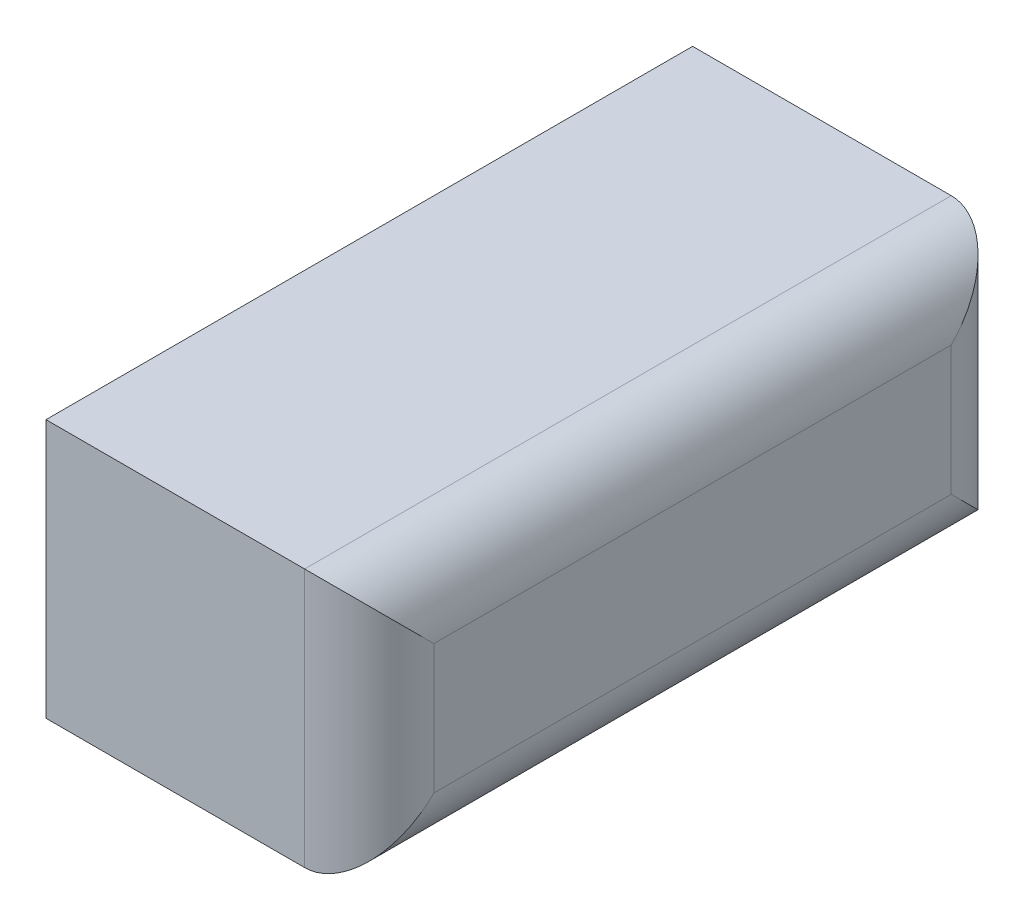
ISO-10303-21;
HEADER;
FILE_DESCRIPTION(('STEP AP214'),'2;1');
FILE_NAME('part.step','',(''),(''),'','','');
FILE_SCHEMA(('AUTOMOTIVE_DESIGN { 1 0 10303 214 1 1 1 1 }'));
ENDSEC;
DATA;
#1=APPLICATION_CONTEXT('core data for automotive mechanical design processes');
#2=APPLICATION_PROTOCOL_DEFINITION('international standard','automotive_design',2000,#1);
#3=PRODUCT_CONTEXT('',#1,'mechanical');
#4=PRODUCT('Part','Part','',(#3));
#5=PRODUCT_RELATED_PRODUCT_CATEGORY('part','',(#4));
#6=PRODUCT_DEFINITION_FORMATION('','',#4);
#7=PRODUCT_DEFINITION_CONTEXT('part definition',#1,'design');
#8=PRODUCT_DEFINITION('design','',#6,#7);
#9=PRODUCT_DEFINITION_SHAPE('','',#8);
#10=(LENGTH_UNIT() NAMED_UNIT(*) SI_UNIT(.MILLI.,.METRE.));
#11=(NAMED_UNIT(*) PLANE_ANGLE_UNIT() SI_UNIT($,.RADIAN.));
#12=(NAMED_UNIT(*) SI_UNIT($,.STERADIAN.) SOLID_ANGLE_UNIT());
#13=UNCERTAINTY_MEASURE_WITH_UNIT(LENGTH_MEASURE(1.E-05),#10,'distance_accuracy_value','');
#14=(GEOMETRIC_REPRESENTATION_CONTEXT(3) GLOBAL_UNCERTAINTY_ASSIGNED_CONTEXT((#13)) GLOBAL_UNIT_ASSIGNED_CONTEXT((#10,
#11,#12)) REPRESENTATION_CONTEXT('',''));
#15=CARTESIAN_POINT('',(0.,0.,0.));
#16=DIRECTION('',(0.,0.,1.));
#17=DIRECTION('',(1.,0.,0.));
#18=AXIS2_PLACEMENT_3D('',#15,#16,#17);
#19=CARTESIAN_POINT('',(0.,0.4,0.));
#20=DIRECTION('',(1.,0.,0.));
#21=DIRECTION('',(0.,0.,-1.));
#22=AXIS2_PLACEMENT_3D('',#19,#20,#21);
#23=PLANE('',#22);
#24=DIRECTION('',(0.,0.,1.));
#25=VECTOR('',#24,1.);
#26=CARTESIAN_POINT('',(0.,0.,0.));
#27=LINE('',#26,#25);
#28=CARTESIAN_POINT('',(0.,0.,-1.));
#29=VERTEX_POINT('',#28);
#30=CARTESIAN_POINT('',(0.,0.,0.));
#31=VERTEX_POINT('',#30);
#32=EDGE_CURVE('E86',#29,#31,#27,.T.);
#33=ORIENTED_EDGE('',*,*,#32,.T.);
#34=DIRECTION('',(0.,-1.,0.));
#35=VECTOR('',#34,1.);
#36=CARTESIAN_POINT('',(0.,0.4,0.));
#37=LINE('',#36,#35);
#38=CARTESIAN_POINT('',(0.,0.4,0.));
#39=VERTEX_POINT('',#38);
#40=EDGE_CURVE('E94',#39,#31,#37,.T.);
#41=ORIENTED_EDGE('',*,*,#40,.F.);
#42=DIRECTION('',(0.,0.,1.));
#43=VECTOR('',#42,1.);
#44=CARTESIAN_POINT('',(0.,0.4,0.));
#45=LINE('',#44,#43);
#46=CARTESIAN_POINT('',(0.,0.4,-1.));
#47=VERTEX_POINT('',#46);
#48=EDGE_CURVE('E113',#47,#39,#45,.T.);
#49=ORIENTED_EDGE('',*,*,#48,.F.);
#50=DIRECTION('',(0.,-1.,0.));
#51=VECTOR('',#50,1.);
#52=CARTESIAN_POINT('',(0.,0.4,-1.));
#53=LINE('',#52,#51);
#54=EDGE_CURVE('E101',#47,#29,#53,.T.);
#55=ORIENTED_EDGE('',*,*,#54,.T.);
#56=EDGE_LOOP('',(#33,#41,#49,#55));
#57=FACE_BOUND('',#56,.T.);
#58=ADVANCED_FACE('F31',(#57),#23,.F.);
#59=CARTESIAN_POINT('',(0.,0.4,0.));
#60=DIRECTION('',(0.,0.,-1.));
#61=DIRECTION('',(-1.,0.,0.));
#62=AXIS2_PLACEMENT_3D('',#59,#60,#61);
#63=PLANE('',#62);
#64=DIRECTION('',(1.,0.,0.));
#65=VECTOR('',#64,1.);
#66=CARTESIAN_POINT('',(0.,0.,0.));
#67=LINE('',#66,#65);
#68=CARTESIAN_POINT('',(0.4,0.,0.));
#69=VERTEX_POINT('',#68);
#70=EDGE_CURVE('E82',#31,#69,#67,.T.);
#71=ORIENTED_EDGE('',*,*,#70,.T.);
#72=DIRECTION('',(0.,-1.,0.));
#73=VECTOR('',#72,1.);
#74=CARTESIAN_POINT('',(0.4,0.4,0.));
#75=LINE('',#74,#73);
#76=CARTESIAN_POINT('',(0.4,0.4,0.));
#77=VERTEX_POINT('',#76);
#78=EDGE_CURVE('E127',#69,#77,#75,.F.);
#79=ORIENTED_EDGE('',*,*,#78,.T.);
#80=DIRECTION('',(1.,0.,0.));
#81=VECTOR('',#80,1.);
#82=CARTESIAN_POINT('',(0.,0.4,0.));
#83=LINE('',#82,#81);
#84=EDGE_CURVE('E96',#39,#77,#83,.T.);
#85=ORIENTED_EDGE('',*,*,#84,.F.);
#86=ORIENTED_EDGE('',*,*,#40,.T.);
#87=EDGE_LOOP('',(#71,#79,#85,#86));
#88=FACE_BOUND('',#87,.T.);
#89=ADVANCED_FACE('F95',(#88),#63,.F.);
#90=CARTESIAN_POINT('',(0.5,0.4,0.));
#91=DIRECTION('',(-1.,0.,0.));
#92=DIRECTION('',(0.,0.,1.));
#93=AXIS2_PLACEMENT_3D('',#90,#91,#92);
#94=PLANE('',#93);
#95=DIRECTION('',(0.,0.,-1.));
#96=VECTOR('',#95,1.);
#97=CARTESIAN_POINT('',(0.5,0.3,0.));
#98=LINE('',#97,#96);
#99=CARTESIAN_POINT('',(0.5,0.3,-0.9));
#100=VERTEX_POINT('',#99);
#101=CARTESIAN_POINT('',(0.5,0.3,-0.1));
#102=VERTEX_POINT('',#101);
#103=EDGE_CURVE('E122',#100,#102,#98,.F.);
#104=ORIENTED_EDGE('',*,*,#103,.T.);
#105=DIRECTION('',(0.,-1.,0.));
#106=VECTOR('',#105,1.);
#107=CARTESIAN_POINT('',(0.5,0.4,-0.1));
#108=LINE('',#107,#106);
#109=CARTESIAN_POINT('',(0.5,0.1,-0.1));
#110=VERTEX_POINT('',#109);
#111=EDGE_CURVE('E124',#102,#110,#108,.T.);
#112=ORIENTED_EDGE('',*,*,#111,.T.);
#113=DIRECTION('',(0.,0.,-1.));
#114=VECTOR('',#113,1.);
#115=CARTESIAN_POINT('',(0.5,0.1,-1.));
#116=LINE('',#115,#114);
#117=CARTESIAN_POINT('',(0.5,0.1,-0.9));
#118=VERTEX_POINT('',#117);
#119=EDGE_CURVE('E100',#110,#118,#116,.T.);
#120=ORIENTED_EDGE('',*,*,#119,.T.);
#121=DIRECTION('',(0.,-1.,0.));
#122=VECTOR('',#121,1.);
#123=CARTESIAN_POINT('',(0.5,0.4,-0.9));
#124=LINE('',#123,#122);
#125=EDGE_CURVE('E120',#118,#100,#124,.F.);
#126=ORIENTED_EDGE('',*,*,#125,.T.);
#127=EDGE_LOOP('',(#104,#112,#120,#126));
#128=FACE_BOUND('',#127,.T.);
#129=ADVANCED_FACE('F153',(#128),#94,.F.);
#130=CARTESIAN_POINT('',(0.,0.4,-1.));
#131=DIRECTION('',(0.,0.,1.));
#132=DIRECTION('',(1.,0.,0.));
#133=AXIS2_PLACEMENT_3D('',#130,#131,#132);
#134=PLANE('',#133);
#135=DIRECTION('',(-1.,0.,0.));
#136=VECTOR('',#135,1.);
#137=CARTESIAN_POINT('',(0.,0.4,-1.));
#138=LINE('',#137,#136);
#139=CARTESIAN_POINT('',(0.400000000000001,0.4,-1.));
#140=VERTEX_POINT('',#139);
#141=EDGE_CURVE('E116',#140,#47,#138,.T.);
#142=ORIENTED_EDGE('',*,*,#141,.F.);
#143=DIRECTION('',(0.,-1.,0.));
#144=VECTOR('',#143,1.);
#145=CARTESIAN_POINT('',(0.400000000000001,0.4,-1.));
#146=LINE('',#145,#144);
#147=CARTESIAN_POINT('',(0.4,0.,-1.));
#148=VERTEX_POINT('',#147);
#149=EDGE_CURVE('E38',#140,#148,#146,.T.);
#150=ORIENTED_EDGE('',*,*,#149,.T.);
#151=DIRECTION('',(-1.,0.,0.));
#152=VECTOR('',#151,1.);
#153=CARTESIAN_POINT('',(0.,0.,-1.));
#154=LINE('',#153,#152);
#155=EDGE_CURVE('E91',#148,#29,#154,.T.);
#156=ORIENTED_EDGE('',*,*,#155,.T.);
#157=ORIENTED_EDGE('',*,*,#54,.F.);
#158=EDGE_LOOP('',(#142,#150,#156,#157));
#159=FACE_BOUND('',#158,.T.);
#160=ADVANCED_FACE('F132',(#159),#134,.F.);
#161=CARTESIAN_POINT('',(0.,0.4,0.));
#162=DIRECTION('',(0.,-1.,0.));
#163=DIRECTION('',(0.,0.,-1.));
#164=AXIS2_PLACEMENT_3D('',#161,#162,#163);
#165=PLANE('',#164);
#166=ORIENTED_EDGE('',*,*,#84,.T.);
#167=DIRECTION('',(0.,0.,-1.));
#168=VECTOR('',#167,1.);
#169=CARTESIAN_POINT('',(0.4,0.4,0.));
#170=LINE('',#169,#168);
#171=EDGE_CURVE('E52',#77,#140,#170,.T.);
#172=ORIENTED_EDGE('',*,*,#171,.T.);
#173=ORIENTED_EDGE('',*,*,#141,.T.);
#174=ORIENTED_EDGE('',*,*,#48,.T.);
#175=EDGE_LOOP('',(#166,#172,#173,#174));
#176=FACE_BOUND('',#175,.T.);
#177=ADVANCED_FACE('F131',(#176),#165,.F.);
#178=CARTESIAN_POINT('',(0.,0.,0.));
#179=DIRECTION('',(0.,-1.,0.));
#180=DIRECTION('',(0.,0.,-1.));
#181=AXIS2_PLACEMENT_3D('',#178,#179,#180);
#182=PLANE('',#181);
#183=ORIENTED_EDGE('',*,*,#155,.F.);
#184=DIRECTION('',(0.,0.,-1.));
#185=VECTOR('',#184,1.);
#186=CARTESIAN_POINT('',(0.4,0.,0.));
#187=LINE('',#186,#185);
#188=EDGE_CURVE('E11',#148,#69,#187,.F.);
#189=ORIENTED_EDGE('',*,*,#188,.T.);
#190=ORIENTED_EDGE('',*,*,#70,.F.);
#191=ORIENTED_EDGE('',*,*,#32,.F.);
#192=EDGE_LOOP('',(#183,#189,#190,#191));
#193=FACE_BOUND('',#192,.T.);
#194=ADVANCED_FACE('F84',(#193),#182,.T.);
#195=CARTESIAN_POINT('',(0.4,0.4,-0.9));
#196=DIRECTION('',(0.,-1.,0.));
#197=DIRECTION('',(0.,0.,-1.));
#198=AXIS2_PLACEMENT_3D('',#195,#196,#197);
#199=CYLINDRICAL_SURFACE('',#198,0.1);
#200=CARTESIAN_POINT('',(0.4,0.1,-0.9));
#201=DIRECTION('',(0.,-0.707106781186547,0.707106781186547));
#202=DIRECTION('',(0.,0.707106781186547,0.707106781186547));
#203=AXIS2_PLACEMENT_3D('',#200,#201,#202);
#204=ELLIPSE('',#203,0.14142135623731,0.1);
#205=EDGE_CURVE('E108',#148,#118,#204,.T.);
#206=ORIENTED_EDGE('',*,*,#205,.F.);
#207=ORIENTED_EDGE('',*,*,#149,.F.);
#208=CARTESIAN_POINT('',(0.4,0.3,-0.9));
#209=DIRECTION('',(0.,-0.707106781186547,-0.707106781186547));
#210=DIRECTION('',(0.,-0.707106781186547,0.707106781186547));
#211=AXIS2_PLACEMENT_3D('',#208,#209,#210);
#212=ELLIPSE('',#211,0.14142135623731,0.1);
#213=EDGE_CURVE('E105',#100,#140,#212,.F.);
#214=ORIENTED_EDGE('',*,*,#213,.F.);
#215=ORIENTED_EDGE('',*,*,#125,.F.);
#216=EDGE_LOOP('',(#206,#207,#214,#215));
#217=FACE_BOUND('',#216,.T.);
#218=ADVANCED_FACE('F137',(#217),#199,.T.);
#219=CARTESIAN_POINT('',(0.4,0.3,0.));
#220=DIRECTION('',(0.,0.,-1.));
#221=DIRECTION('',(-1.,0.,0.));
#222=AXIS2_PLACEMENT_3D('',#219,#220,#221);
#223=CYLINDRICAL_SURFACE('',#222,0.1);
#224=ORIENTED_EDGE('',*,*,#213,.T.);
#225=ORIENTED_EDGE('',*,*,#171,.F.);
#226=CARTESIAN_POINT('',(0.4,0.3,-0.1));
#227=DIRECTION('',(0.,0.707106781186547,-0.707106781186547));
#228=DIRECTION('',(0.,-0.707106781186547,-0.707106781186547));
#229=AXIS2_PLACEMENT_3D('',#226,#227,#228);
#230=ELLIPSE('',#229,0.14142135623731,0.1);
#231=EDGE_CURVE('E141',#102,#77,#230,.F.);
#232=ORIENTED_EDGE('',*,*,#231,.F.);
#233=ORIENTED_EDGE('',*,*,#103,.F.);
#234=EDGE_LOOP('',(#224,#225,#232,#233));
#235=FACE_BOUND('',#234,.T.);
#236=ADVANCED_FACE('F151',(#235),#223,.T.);
#237=CARTESIAN_POINT('',(0.4,0.1,0.));
#238=DIRECTION('',(0.,0.,1.));
#239=DIRECTION('',(1.,0.,0.));
#240=AXIS2_PLACEMENT_3D('',#237,#238,#239);
#241=CYLINDRICAL_SURFACE('',#240,0.1);
#242=ORIENTED_EDGE('',*,*,#205,.T.);
#243=ORIENTED_EDGE('',*,*,#119,.F.);
#244=CARTESIAN_POINT('',(0.4,0.1,-0.1));
#245=DIRECTION('',(0.,0.707106781186547,0.707106781186547));
#246=DIRECTION('',(0.,-0.707106781186547,0.707106781186547));
#247=AXIS2_PLACEMENT_3D('',#244,#245,#246);
#248=ELLIPSE('',#247,0.14142135623731,0.1);
#249=EDGE_CURVE('E143',#69,#110,#248,.T.);
#250=ORIENTED_EDGE('',*,*,#249,.F.);
#251=ORIENTED_EDGE('',*,*,#188,.F.);
#252=EDGE_LOOP('',(#242,#243,#250,#251));
#253=FACE_BOUND('',#252,.T.);
#254=ADVANCED_FACE('F142',(#253),#241,.T.);
#255=CARTESIAN_POINT('',(0.4,0.4,-0.1));
#256=DIRECTION('',(0.,-1.,0.));
#257=DIRECTION('',(0.,0.,-1.));
#258=AXIS2_PLACEMENT_3D('',#255,#256,#257);
#259=CYLINDRICAL_SURFACE('',#258,0.1);
#260=ORIENTED_EDGE('',*,*,#231,.T.);
#261=ORIENTED_EDGE('',*,*,#78,.F.);
#262=ORIENTED_EDGE('',*,*,#249,.T.);
#263=ORIENTED_EDGE('',*,*,#111,.F.);
#264=EDGE_LOOP('',(#260,#261,#262,#263));
#265=FACE_BOUND('',#264,.T.);
#266=ADVANCED_FACE('F148',(#265),#259,.T.);
#267=CLOSED_SHELL('',(#58,#89,#129,#160,#177,#194,#218,#236,#254,#266));
#268=MANIFOLD_SOLID_BREP('B2',#267);
#269=ADVANCED_BREP_SHAPE_REPRESENTATION('',(#18,#268),#14);
#270=SHAPE_DEFINITION_REPRESENTATION(#9,#269);
ENDSEC;
END-ISO-10303-21;
